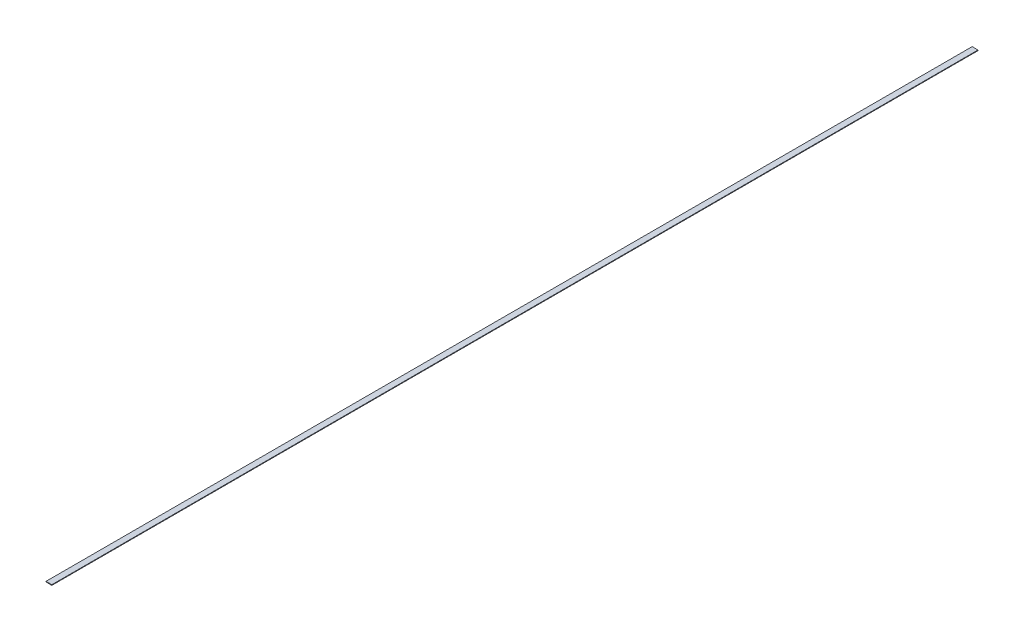
ISO-10303-21;
HEADER;
FILE_DESCRIPTION(('STEP AP214'),'2;1');
FILE_NAME('part.step','',(''),(''),'','','');
FILE_SCHEMA(('AUTOMOTIVE_DESIGN { 1 0 10303 214 1 1 1 1 }'));
ENDSEC;
DATA;
#1=APPLICATION_CONTEXT('core data for automotive mechanical design processes');
#2=APPLICATION_PROTOCOL_DEFINITION('international standard','automotive_design',2000,#1);
#3=PRODUCT_CONTEXT('',#1,'mechanical');
#4=PRODUCT('Part','Part','',(#3));
#5=PRODUCT_RELATED_PRODUCT_CATEGORY('part','',(#4));
#6=PRODUCT_DEFINITION_FORMATION('','',#4);
#7=PRODUCT_DEFINITION_CONTEXT('part definition',#1,'design');
#8=PRODUCT_DEFINITION('design','',#6,#7);
#9=PRODUCT_DEFINITION_SHAPE('','',#8);
#10=(LENGTH_UNIT() NAMED_UNIT(*) SI_UNIT(.MILLI.,.METRE.));
#11=(NAMED_UNIT(*) PLANE_ANGLE_UNIT() SI_UNIT($,.RADIAN.));
#12=(NAMED_UNIT(*) SI_UNIT($,.STERADIAN.) SOLID_ANGLE_UNIT());
#13=UNCERTAINTY_MEASURE_WITH_UNIT(LENGTH_MEASURE(1.E-05),#10,'distance_accuracy_value','');
#14=(GEOMETRIC_REPRESENTATION_CONTEXT(3) GLOBAL_UNCERTAINTY_ASSIGNED_CONTEXT((#13)) GLOBAL_UNIT_ASSIGNED_CONTEXT((#10,
#11,#12)) REPRESENTATION_CONTEXT('',''));
#15=CARTESIAN_POINT('',(0.,0.,0.));
#16=DIRECTION('',(0.,0.,1.));
#17=DIRECTION('',(1.,0.,0.));
#18=AXIS2_PLACEMENT_3D('',#15,#16,#17);
#19=CARTESIAN_POINT('',(0.,5.08,0.));
#20=DIRECTION('',(1.,0.,0.));
#21=DIRECTION('',(0.,0.,-1.));
#22=AXIS2_PLACEMENT_3D('',#19,#20,#21);
#23=PLANE('',#22);
#24=DIRECTION('',(0.,0.,1.));
#25=VECTOR('',#24,1.);
#26=CARTESIAN_POINT('',(0.,0.,0.));
#27=LINE('',#26,#25);
#28=CARTESIAN_POINT('',(0.,0.,-8051.8));
#29=VERTEX_POINT('',#28);
#30=CARTESIAN_POINT('',(0.,0.,0.));
#31=VERTEX_POINT('',#30);
#32=EDGE_CURVE('E111',#29,#31,#27,.T.);
#33=ORIENTED_EDGE('',*,*,#32,.T.);
#34=DIRECTION('',(0.,-1.,0.));
#35=VECTOR('',#34,1.);
#36=CARTESIAN_POINT('',(0.,5.08,0.));
#37=LINE('',#36,#35);
#38=CARTESIAN_POINT('',(0.,5.08,0.));
#39=VERTEX_POINT('',#38);
#40=EDGE_CURVE('E11',#39,#31,#37,.T.);
#41=ORIENTED_EDGE('',*,*,#40,.F.);
#42=DIRECTION('',(0.,0.,1.));
#43=VECTOR('',#42,1.);
#44=CARTESIAN_POINT('',(0.,5.08,0.));
#45=LINE('',#44,#43);
#46=CARTESIAN_POINT('',(0.,5.08,-8051.8));
#47=VERTEX_POINT('',#46);
#48=EDGE_CURVE('E94',#47,#39,#45,.T.);
#49=ORIENTED_EDGE('',*,*,#48,.F.);
#50=DIRECTION('',(0.,-1.,0.));
#51=VECTOR('',#50,1.);
#52=CARTESIAN_POINT('',(0.,5.08,-8051.8));
#53=LINE('',#52,#51);
#54=EDGE_CURVE('E107',#47,#29,#53,.T.);
#55=ORIENTED_EDGE('',*,*,#54,.T.);
#56=EDGE_LOOP('',(#33,#41,#49,#55));
#57=FACE_BOUND('',#56,.T.);
#58=ADVANCED_FACE('F38',(#57),#23,.F.);
#59=CARTESIAN_POINT('',(0.,5.08,0.));
#60=DIRECTION('',(0.,0.,-1.));
#61=DIRECTION('',(-1.,0.,0.));
#62=AXIS2_PLACEMENT_3D('',#59,#60,#61);
#63=PLANE('',#62);
#64=DIRECTION('',(1.,0.,0.));
#65=VECTOR('',#64,1.);
#66=CARTESIAN_POINT('',(0.,0.,0.));
#67=LINE('',#66,#65);
#68=CARTESIAN_POINT('',(50.8,0.,0.));
#69=VERTEX_POINT('',#68);
#70=EDGE_CURVE('E99',#31,#69,#67,.T.);
#71=ORIENTED_EDGE('',*,*,#70,.T.);
#72=DIRECTION('',(0.,-1.,0.));
#73=VECTOR('',#72,1.);
#74=CARTESIAN_POINT('',(50.8,5.08,0.));
#75=LINE('',#74,#73);
#76=CARTESIAN_POINT('',(50.8,5.08,0.));
#77=VERTEX_POINT('',#76);
#78=EDGE_CURVE('E47',#77,#69,#75,.T.);
#79=ORIENTED_EDGE('',*,*,#78,.F.);
#80=DIRECTION('',(1.,0.,0.));
#81=VECTOR('',#80,1.);
#82=CARTESIAN_POINT('',(0.,5.08,0.));
#83=LINE('',#82,#81);
#84=EDGE_CURVE('E89',#39,#77,#83,.T.);
#85=ORIENTED_EDGE('',*,*,#84,.F.);
#86=ORIENTED_EDGE('',*,*,#40,.T.);
#87=EDGE_LOOP('',(#71,#79,#85,#86));
#88=FACE_BOUND('',#87,.T.);
#89=ADVANCED_FACE('F98',(#88),#63,.F.);
#90=CARTESIAN_POINT('',(50.8,5.08,0.));
#91=DIRECTION('',(-1.,0.,0.));
#92=DIRECTION('',(0.,0.,1.));
#93=AXIS2_PLACEMENT_3D('',#90,#91,#92);
#94=PLANE('',#93);
#95=DIRECTION('',(0.,0.,-1.));
#96=VECTOR('',#95,1.);
#97=CARTESIAN_POINT('',(50.8,0.,0.));
#98=LINE('',#97,#96);
#99=CARTESIAN_POINT('',(50.8,0.,-8051.8));
#100=VERTEX_POINT('',#99);
#101=EDGE_CURVE('E74',#69,#100,#98,.T.);
#102=ORIENTED_EDGE('',*,*,#101,.T.);
#103=DIRECTION('',(0.,-1.,0.));
#104=VECTOR('',#103,1.);
#105=CARTESIAN_POINT('',(50.8,5.08,-8051.8));
#106=LINE('',#105,#104);
#107=CARTESIAN_POINT('',(50.8,5.08,-8051.8));
#108=VERTEX_POINT('',#107);
#109=EDGE_CURVE('E101',#108,#100,#106,.T.);
#110=ORIENTED_EDGE('',*,*,#109,.F.);
#111=DIRECTION('',(0.,0.,-1.));
#112=VECTOR('',#111,1.);
#113=CARTESIAN_POINT('',(50.8,5.08,0.));
#114=LINE('',#113,#112);
#115=EDGE_CURVE('E92',#77,#108,#114,.T.);
#116=ORIENTED_EDGE('',*,*,#115,.F.);
#117=ORIENTED_EDGE('',*,*,#78,.T.);
#118=EDGE_LOOP('',(#102,#110,#116,#117));
#119=FACE_BOUND('',#118,.T.);
#120=ADVANCED_FACE('F102',(#119),#94,.F.);
#121=CARTESIAN_POINT('',(0.,5.08,-8051.8));
#122=DIRECTION('',(0.,0.,1.));
#123=DIRECTION('',(1.,0.,0.));
#124=AXIS2_PLACEMENT_3D('',#121,#122,#123);
#125=PLANE('',#124);
#126=DIRECTION('',(-1.,0.,0.));
#127=VECTOR('',#126,1.);
#128=CARTESIAN_POINT('',(0.,0.,-8051.8));
#129=LINE('',#128,#127);
#130=EDGE_CURVE('E80',#100,#29,#129,.T.);
#131=ORIENTED_EDGE('',*,*,#130,.T.);
#132=ORIENTED_EDGE('',*,*,#54,.F.);
#133=DIRECTION('',(-1.,0.,0.));
#134=VECTOR('',#133,1.);
#135=CARTESIAN_POINT('',(0.,5.08,-8051.8));
#136=LINE('',#135,#134);
#137=EDGE_CURVE('E55',#108,#47,#136,.T.);
#138=ORIENTED_EDGE('',*,*,#137,.F.);
#139=ORIENTED_EDGE('',*,*,#109,.T.);
#140=EDGE_LOOP('',(#131,#132,#138,#139));
#141=FACE_BOUND('',#140,.T.);
#142=ADVANCED_FACE('F119',(#141),#125,.F.);
#143=CARTESIAN_POINT('',(0.,5.08,0.));
#144=DIRECTION('',(0.,-1.,0.));
#145=DIRECTION('',(0.,0.,-1.));
#146=AXIS2_PLACEMENT_3D('',#143,#144,#145);
#147=PLANE('',#146);
#148=ORIENTED_EDGE('',*,*,#48,.T.);
#149=ORIENTED_EDGE('',*,*,#84,.T.);
#150=ORIENTED_EDGE('',*,*,#115,.T.);
#151=ORIENTED_EDGE('',*,*,#137,.T.);
#152=EDGE_LOOP('',(#148,#149,#150,#151));
#153=FACE_BOUND('',#152,.T.);
#154=ADVANCED_FACE('F90',(#153),#147,.F.);
#155=CARTESIAN_POINT('',(0.,0.,0.));
#156=DIRECTION('',(0.,-1.,0.));
#157=DIRECTION('',(0.,0.,-1.));
#158=AXIS2_PLACEMENT_3D('',#155,#156,#157);
#159=PLANE('',#158);
#160=ORIENTED_EDGE('',*,*,#32,.F.);
#161=ORIENTED_EDGE('',*,*,#130,.F.);
#162=ORIENTED_EDGE('',*,*,#101,.F.);
#163=ORIENTED_EDGE('',*,*,#70,.F.);
#164=EDGE_LOOP('',(#160,#161,#162,#163));
#165=FACE_BOUND('',#164,.T.);
#166=ADVANCED_FACE('F122',(#165),#159,.T.);
#167=CLOSED_SHELL('',(#58,#89,#120,#142,#154,#166));
#168=MANIFOLD_SOLID_BREP('B2',#167);
#169=ADVANCED_BREP_SHAPE_REPRESENTATION('',(#18,#168),#14);
#170=SHAPE_DEFINITION_REPRESENTATION(#9,#169);
ENDSEC;
END-ISO-10303-21;
